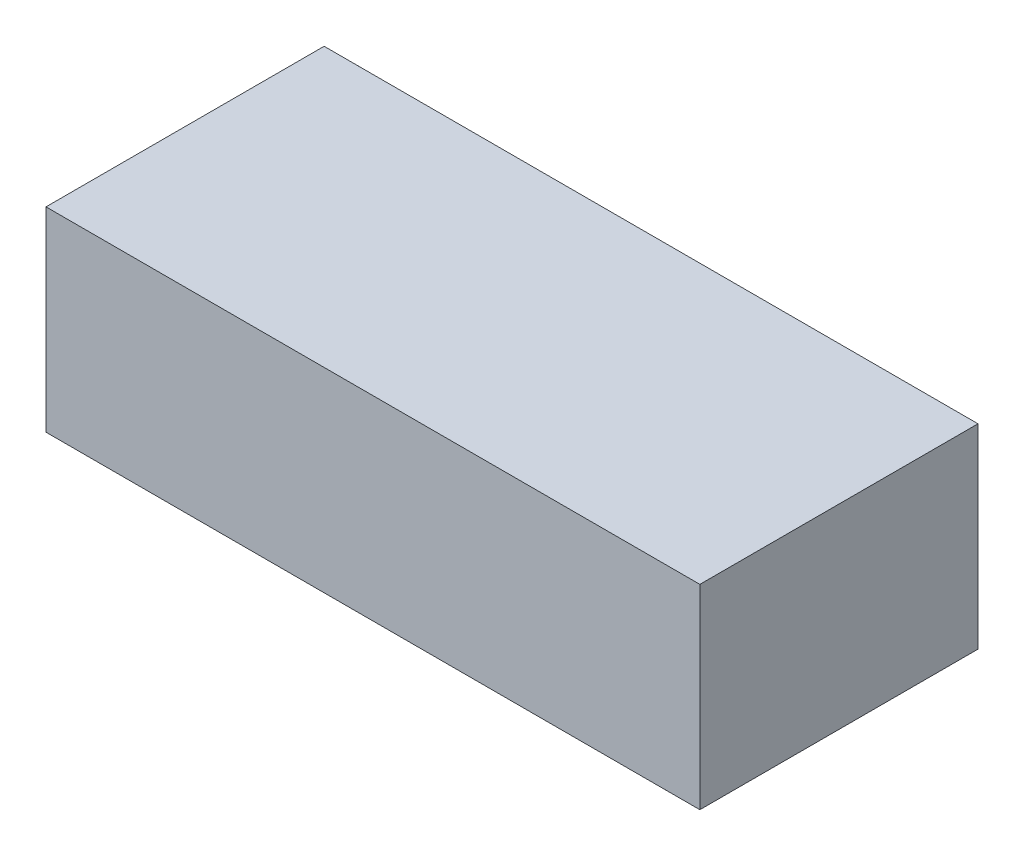
ISO-10303-21;
HEADER;
FILE_DESCRIPTION(('STEP AP214'),'2;1');
FILE_NAME('part.step','',(''),(''),'','','');
FILE_SCHEMA(('AUTOMOTIVE_DESIGN { 1 0 10303 214 1 1 1 1 }'));
ENDSEC;
DATA;
#1=APPLICATION_CONTEXT('core data for automotive mechanical design processes');
#2=APPLICATION_PROTOCOL_DEFINITION('international standard','automotive_design',2000,#1);
#3=PRODUCT_CONTEXT('',#1,'mechanical');
#4=PRODUCT('Part','Part','',(#3));
#5=PRODUCT_RELATED_PRODUCT_CATEGORY('part','',(#4));
#6=PRODUCT_DEFINITION_FORMATION('','',#4);
#7=PRODUCT_DEFINITION_CONTEXT('part definition',#1,'design');
#8=PRODUCT_DEFINITION('design','',#6,#7);
#9=PRODUCT_DEFINITION_SHAPE('','',#8);
#10=(LENGTH_UNIT() NAMED_UNIT(*) SI_UNIT(.MILLI.,.METRE.));
#11=(NAMED_UNIT(*) PLANE_ANGLE_UNIT() SI_UNIT($,.RADIAN.));
#12=(NAMED_UNIT(*) SI_UNIT($,.STERADIAN.) SOLID_ANGLE_UNIT());
#13=UNCERTAINTY_MEASURE_WITH_UNIT(LENGTH_MEASURE(1.E-05),#10,'distance_accuracy_value','');
#14=(GEOMETRIC_REPRESENTATION_CONTEXT(3) GLOBAL_UNCERTAINTY_ASSIGNED_CONTEXT((#13)) GLOBAL_UNIT_ASSIGNED_CONTEXT((#10,
#11,#12)) REPRESENTATION_CONTEXT('',''));
#15=CARTESIAN_POINT('',(0.,0.,0.));
#16=DIRECTION('',(0.,0.,1.));
#17=DIRECTION('',(1.,0.,0.));
#18=AXIS2_PLACEMENT_3D('',#15,#16,#17);
#19=CARTESIAN_POINT('',(0.,0.,0.));
#20=DIRECTION('',(0.,-1.,0.));
#21=DIRECTION('',(0.,0.,-1.));
#22=AXIS2_PLACEMENT_3D('',#19,#20,#21);
#23=PLANE('',#22);
#24=DIRECTION('',(0.,0.,-1.));
#25=VECTOR('',#24,1.);
#26=CARTESIAN_POINT('',(-1.7018,0.,0.7239));
#27=LINE('',#26,#25);
#28=CARTESIAN_POINT('',(-1.7018,0.,0.7239));
#29=VERTEX_POINT('',#28);
#30=CARTESIAN_POINT('',(-1.7018,0.,-0.7239));
#31=VERTEX_POINT('',#30);
#32=EDGE_CURVE('E52',#29,#31,#27,.T.);
#33=ORIENTED_EDGE('',*,*,#32,.T.);
#34=DIRECTION('',(1.,0.,0.));
#35=VECTOR('',#34,1.);
#36=CARTESIAN_POINT('',(-1.7018,0.,-0.7239));
#37=LINE('',#36,#35);
#38=CARTESIAN_POINT('',(1.7018,0.,-0.7239));
#39=VERTEX_POINT('',#38);
#40=EDGE_CURVE('E73',#31,#39,#37,.T.);
#41=ORIENTED_EDGE('',*,*,#40,.T.);
#42=DIRECTION('',(0.,0.,1.));
#43=VECTOR('',#42,1.);
#44=CARTESIAN_POINT('',(1.7018,0.,0.7239));
#45=LINE('',#44,#43);
#46=CARTESIAN_POINT('',(1.7018,0.,0.7239));
#47=VERTEX_POINT('',#46);
#48=EDGE_CURVE('E55',#39,#47,#45,.T.);
#49=ORIENTED_EDGE('',*,*,#48,.T.);
#50=DIRECTION('',(-1.,0.,0.));
#51=VECTOR('',#50,1.);
#52=CARTESIAN_POINT('',(-1.7018,0.,0.7239));
#53=LINE('',#52,#51);
#54=EDGE_CURVE('E17',#47,#29,#53,.T.);
#55=ORIENTED_EDGE('',*,*,#54,.T.);
#56=EDGE_LOOP('',(#33,#41,#49,#55));
#57=FACE_BOUND('',#56,.T.);
#58=ADVANCED_FACE('F14',(#57),#23,.T.);
#59=CARTESIAN_POINT('',(-1.7018,1.016,0.7239));
#60=DIRECTION('',(0.,0.,-1.));
#61=DIRECTION('',(-1.,0.,0.));
#62=AXIS2_PLACEMENT_3D('',#59,#60,#61);
#63=PLANE('',#62);
#64=DIRECTION('',(0.,1.,0.));
#65=VECTOR('',#64,1.);
#66=CARTESIAN_POINT('',(1.7018,1.016,0.7239));
#67=LINE('',#66,#65);
#68=CARTESIAN_POINT('',(1.7018,1.016,0.7239));
#69=VERTEX_POINT('',#68);
#70=EDGE_CURVE('E75',#47,#69,#67,.T.);
#71=ORIENTED_EDGE('',*,*,#70,.T.);
#72=DIRECTION('',(1.,0.,0.));
#73=VECTOR('',#72,1.);
#74=CARTESIAN_POINT('',(0.,1.016,0.7239));
#75=LINE('',#74,#73);
#76=CARTESIAN_POINT('',(-1.7018,1.016,0.7239));
#77=VERTEX_POINT('',#76);
#78=EDGE_CURVE('E70',#69,#77,#75,.F.);
#79=ORIENTED_EDGE('',*,*,#78,.T.);
#80=DIRECTION('',(0.,1.,0.));
#81=VECTOR('',#80,1.);
#82=CARTESIAN_POINT('',(-1.7018,1.016,0.7239));
#83=LINE('',#82,#81);
#84=EDGE_CURVE('E60',#77,#29,#83,.F.);
#85=ORIENTED_EDGE('',*,*,#84,.T.);
#86=ORIENTED_EDGE('',*,*,#54,.F.);
#87=EDGE_LOOP('',(#71,#79,#85,#86));
#88=FACE_BOUND('',#87,.T.);
#89=ADVANCED_FACE('F69',(#88),#63,.F.);
#90=CARTESIAN_POINT('',(-1.7018,1.016,0.7239));
#91=DIRECTION('',(1.,0.,0.));
#92=DIRECTION('',(0.,0.,-1.));
#93=AXIS2_PLACEMENT_3D('',#90,#91,#92);
#94=PLANE('',#93);
#95=ORIENTED_EDGE('',*,*,#84,.F.);
#96=DIRECTION('',(0.,0.,-1.));
#97=VECTOR('',#96,1.);
#98=CARTESIAN_POINT('',(-1.7018,1.016,0.));
#99=LINE('',#98,#97);
#100=CARTESIAN_POINT('',(-1.7018,1.016,-0.7239));
#101=VERTEX_POINT('',#100);
#102=EDGE_CURVE('E80',#77,#101,#99,.T.);
#103=ORIENTED_EDGE('',*,*,#102,.T.);
#104=DIRECTION('',(0.,1.,0.));
#105=VECTOR('',#104,1.);
#106=CARTESIAN_POINT('',(-1.7018,1.016,-0.7239));
#107=LINE('',#106,#105);
#108=EDGE_CURVE('E66',#101,#31,#107,.F.);
#109=ORIENTED_EDGE('',*,*,#108,.T.);
#110=ORIENTED_EDGE('',*,*,#32,.F.);
#111=EDGE_LOOP('',(#95,#103,#109,#110));
#112=FACE_BOUND('',#111,.T.);
#113=ADVANCED_FACE('F63',(#112),#94,.F.);
#114=CARTESIAN_POINT('',(-1.7018,1.016,-0.7239));
#115=DIRECTION('',(0.,0.,1.));
#116=DIRECTION('',(1.,0.,0.));
#117=AXIS2_PLACEMENT_3D('',#114,#115,#116);
#118=PLANE('',#117);
#119=ORIENTED_EDGE('',*,*,#108,.F.);
#120=DIRECTION('',(1.,0.,0.));
#121=VECTOR('',#120,1.);
#122=CARTESIAN_POINT('',(0.,1.016,-0.7239));
#123=LINE('',#122,#121);
#124=CARTESIAN_POINT('',(1.7018,1.016,-0.7239));
#125=VERTEX_POINT('',#124);
#126=EDGE_CURVE('E23',#101,#125,#123,.T.);
#127=ORIENTED_EDGE('',*,*,#126,.T.);
#128=DIRECTION('',(0.,1.,0.));
#129=VECTOR('',#128,1.);
#130=CARTESIAN_POINT('',(1.7018,1.016,-0.7239));
#131=LINE('',#130,#129);
#132=EDGE_CURVE('E31',#125,#39,#131,.F.);
#133=ORIENTED_EDGE('',*,*,#132,.T.);
#134=ORIENTED_EDGE('',*,*,#40,.F.);
#135=EDGE_LOOP('',(#119,#127,#133,#134));
#136=FACE_BOUND('',#135,.T.);
#137=ADVANCED_FACE('F85',(#136),#118,.F.);
#138=CARTESIAN_POINT('',(1.7018,1.016,0.7239));
#139=DIRECTION('',(-1.,0.,0.));
#140=DIRECTION('',(0.,0.,1.));
#141=AXIS2_PLACEMENT_3D('',#138,#139,#140);
#142=PLANE('',#141);
#143=ORIENTED_EDGE('',*,*,#132,.F.);
#144=DIRECTION('',(0.,0.,-1.));
#145=VECTOR('',#144,1.);
#146=CARTESIAN_POINT('',(1.7018,1.016,0.));
#147=LINE('',#146,#145);
#148=EDGE_CURVE('E9',#125,#69,#147,.F.);
#149=ORIENTED_EDGE('',*,*,#148,.T.);
#150=ORIENTED_EDGE('',*,*,#70,.F.);
#151=ORIENTED_EDGE('',*,*,#48,.F.);
#152=EDGE_LOOP('',(#143,#149,#150,#151));
#153=FACE_BOUND('',#152,.T.);
#154=ADVANCED_FACE('F88',(#153),#142,.F.);
#155=CARTESIAN_POINT('',(0.,1.016,0.));
#156=DIRECTION('',(0.,-1.,0.));
#157=DIRECTION('',(0.,0.,-1.));
#158=AXIS2_PLACEMENT_3D('',#155,#156,#157);
#159=PLANE('',#158);
#160=ORIENTED_EDGE('',*,*,#126,.F.);
#161=ORIENTED_EDGE('',*,*,#102,.F.);
#162=ORIENTED_EDGE('',*,*,#78,.F.);
#163=ORIENTED_EDGE('',*,*,#148,.F.);
#164=EDGE_LOOP('',(#160,#161,#162,#163));
#165=FACE_BOUND('',#164,.T.);
#166=ADVANCED_FACE('F87',(#165),#159,.F.);
#167=CLOSED_SHELL('',(#58,#89,#113,#137,#154,#166));
#168=MANIFOLD_SOLID_BREP('B1',#167);
#169=ADVANCED_BREP_SHAPE_REPRESENTATION('',(#18,#168),#14);
#170=SHAPE_DEFINITION_REPRESENTATION(#9,#169);
ENDSEC;
END-ISO-10303-21;
